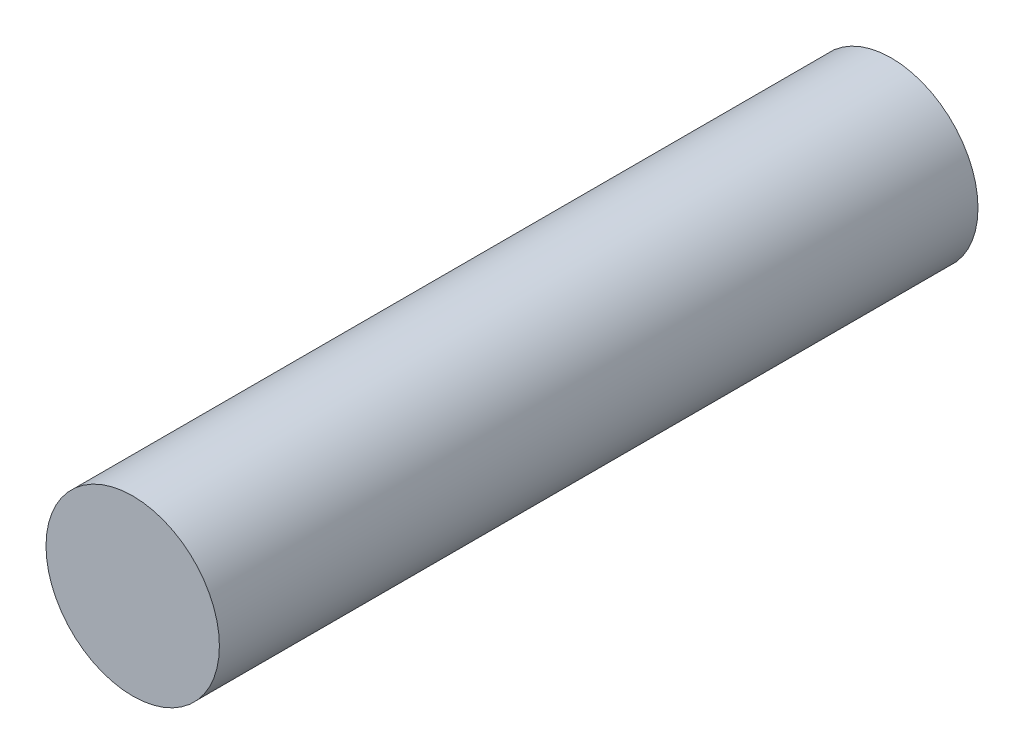
ISO-10303-21;
HEADER;
FILE_DESCRIPTION(('STEP AP214'),'2;1');
FILE_NAME('part.step','',(''),(''),'','','');
FILE_SCHEMA(('AUTOMOTIVE_DESIGN { 1 0 10303 214 1 1 1 1 }'));
ENDSEC;
DATA;
#1=APPLICATION_CONTEXT('core data for automotive mechanical design processes');
#2=APPLICATION_PROTOCOL_DEFINITION('international standard','automotive_design',2000,#1);
#3=PRODUCT_CONTEXT('',#1,'mechanical');
#4=PRODUCT('Part','Part','',(#3));
#5=PRODUCT_RELATED_PRODUCT_CATEGORY('part','',(#4));
#6=PRODUCT_DEFINITION_FORMATION('','',#4);
#7=PRODUCT_DEFINITION_CONTEXT('part definition',#1,'design');
#8=PRODUCT_DEFINITION('design','',#6,#7);
#9=PRODUCT_DEFINITION_SHAPE('','',#8);
#10=(LENGTH_UNIT() NAMED_UNIT(*) SI_UNIT(.MILLI.,.METRE.));
#11=(NAMED_UNIT(*) PLANE_ANGLE_UNIT() SI_UNIT($,.RADIAN.));
#12=(NAMED_UNIT(*) SI_UNIT($,.STERADIAN.) SOLID_ANGLE_UNIT());
#13=UNCERTAINTY_MEASURE_WITH_UNIT(LENGTH_MEASURE(1.E-05),#10,'distance_accuracy_value','');
#14=(GEOMETRIC_REPRESENTATION_CONTEXT(3) GLOBAL_UNCERTAINTY_ASSIGNED_CONTEXT((#13)) GLOBAL_UNIT_ASSIGNED_CONTEXT((#10,
#11,#12)) REPRESENTATION_CONTEXT('',''));
#15=CARTESIAN_POINT('',(0.,0.,0.));
#16=DIRECTION('',(0.,0.,1.));
#17=DIRECTION('',(1.,0.,0.));
#18=AXIS2_PLACEMENT_3D('',#15,#16,#17);
#19=CARTESIAN_POINT('',(0.,0.,-26.25));
#20=DIRECTION('',(0.,0.,-1.));
#21=DIRECTION('',(-1.,0.,0.));
#22=AXIS2_PLACEMENT_3D('',#19,#20,#21);
#23=PLANE('',#22);
#24=CARTESIAN_POINT('',(0.,0.,-26.25));
#25=DIRECTION('',(0.,0.,1.));
#26=DIRECTION('',(1.,0.,0.));
#27=AXIS2_PLACEMENT_3D('',#24,#25,#26);
#28=CIRCLE('',#27,2.);
#29=CARTESIAN_POINT('',(2.,0.,-26.25));
#30=VERTEX_POINT('',#29);
#31=EDGE_CURVE('E10',#30,#30,#28,.T.);
#32=ORIENTED_EDGE('',*,*,#31,.F.);
#33=EDGE_LOOP('',(#32));
#34=FACE_BOUND('',#33,.T.);
#35=ADVANCED_FACE('F35',(#34),#23,.T.);
#36=CARTESIAN_POINT('',(0.,0.,-8.75));
#37=DIRECTION('',(0.,0.,1.));
#38=DIRECTION('',(1.,0.,0.));
#39=AXIS2_PLACEMENT_3D('',#36,#37,#38);
#40=CYLINDRICAL_SURFACE('',#39,2.);
#41=ORIENTED_EDGE('',*,*,#31,.T.);
#42=EDGE_LOOP('',(#41));
#43=FACE_BOUND('',#42,.T.);
#44=CARTESIAN_POINT('',(0.,0.,-8.75));
#45=DIRECTION('',(0.,0.,1.));
#46=DIRECTION('',(1.,0.,0.));
#47=AXIS2_PLACEMENT_3D('',#44,#45,#46);
#48=CIRCLE('',#47,2.);
#49=CARTESIAN_POINT('',(2.,0.,-8.75));
#50=VERTEX_POINT('',#49);
#51=EDGE_CURVE('E41',#50,#50,#48,.T.);
#52=ORIENTED_EDGE('',*,*,#51,.F.);
#53=EDGE_LOOP('',(#52));
#54=FACE_BOUND('',#53,.T.);
#55=ADVANCED_FACE('F49',(#43,#54),#40,.T.);
#56=CARTESIAN_POINT('',(0.,0.,-8.75));
#57=DIRECTION('',(0.,0.,1.));
#58=DIRECTION('',(1.,0.,0.));
#59=AXIS2_PLACEMENT_3D('',#56,#57,#58);
#60=PLANE('',#59);
#61=ORIENTED_EDGE('',*,*,#51,.T.);
#62=EDGE_LOOP('',(#61));
#63=FACE_BOUND('',#62,.T.);
#64=ADVANCED_FACE('F47',(#63),#60,.T.);
#65=CLOSED_SHELL('',(#35,#55,#64));
#66=MANIFOLD_SOLID_BREP('B2',#65);
#67=ADVANCED_BREP_SHAPE_REPRESENTATION('',(#18,#66),#14);
#68=SHAPE_DEFINITION_REPRESENTATION(#9,#67);
ENDSEC;
END-ISO-10303-21;
